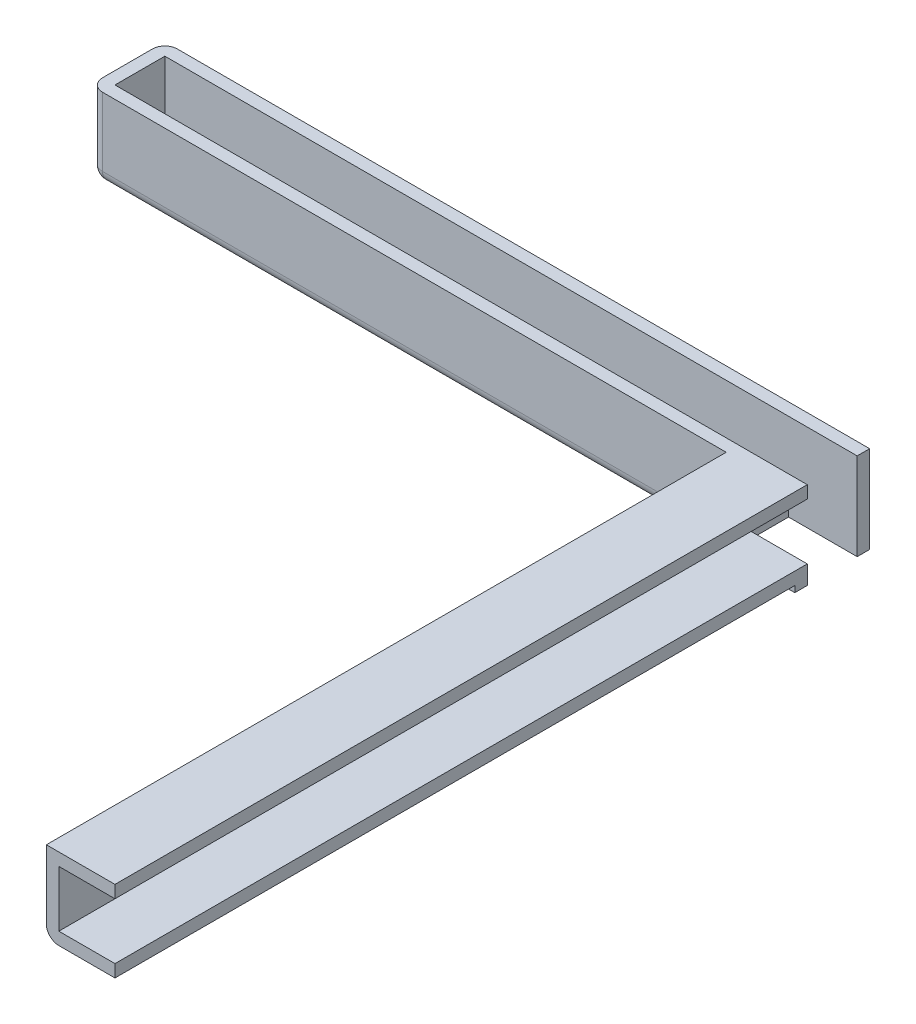
ISO-10303-21;
HEADER;
FILE_DESCRIPTION(('STEP AP214'),'2;1');
FILE_NAME('part.step','',(''),(''),'','','');
FILE_SCHEMA(('AUTOMOTIVE_DESIGN { 1 0 10303 214 1 1 1 1 }'));
ENDSEC;
DATA;
#1=APPLICATION_CONTEXT('core data for automotive mechanical design processes');
#2=APPLICATION_PROTOCOL_DEFINITION('international standard','automotive_design',2000,#1);
#3=PRODUCT_CONTEXT('',#1,'mechanical');
#4=PRODUCT('Part','Part','',(#3));
#5=PRODUCT_RELATED_PRODUCT_CATEGORY('part','',(#4));
#6=PRODUCT_DEFINITION_FORMATION('','',#4);
#7=PRODUCT_DEFINITION_CONTEXT('part definition',#1,'design');
#8=PRODUCT_DEFINITION('design','',#6,#7);
#9=PRODUCT_DEFINITION_SHAPE('','',#8);
#10=(LENGTH_UNIT() NAMED_UNIT(*) SI_UNIT(.MILLI.,.METRE.));
#11=(NAMED_UNIT(*) PLANE_ANGLE_UNIT() SI_UNIT($,.RADIAN.));
#12=(NAMED_UNIT(*) SI_UNIT($,.STERADIAN.) SOLID_ANGLE_UNIT());
#13=UNCERTAINTY_MEASURE_WITH_UNIT(LENGTH_MEASURE(1.E-05),#10,'distance_accuracy_value','');
#14=(GEOMETRIC_REPRESENTATION_CONTEXT(3) GLOBAL_UNCERTAINTY_ASSIGNED_CONTEXT((#13)) GLOBAL_UNIT_ASSIGNED_CONTEXT((#10,
#11,#12)) REPRESENTATION_CONTEXT('',''));
#15=CARTESIAN_POINT('',(0.,0.,0.));
#16=DIRECTION('',(0.,0.,1.));
#17=DIRECTION('',(1.,0.,0.));
#18=AXIS2_PLACEMENT_3D('',#15,#16,#17);
#19=CARTESIAN_POINT('',(0.,2.,12.));
#20=DIRECTION('',(0.,0.,-1.));
#21=DIRECTION('',(-1.,0.,0.));
#22=AXIS2_PLACEMENT_3D('',#19,#20,#21);
#23=PLANE('',#22);
#24=CARTESIAN_POINT('',(104.,2.,12.));
#25=DIRECTION('',(0.,0.,-1.));
#26=DIRECTION('',(-1.,0.,0.));
#27=AXIS2_PLACEMENT_3D('',#24,#25,#26);
#28=CIRCLE('',#27,2.);
#29=CARTESIAN_POINT('',(104.,0.,12.));
#30=VERTEX_POINT('',#29);
#31=CARTESIAN_POINT('',(102.,2.,12.));
#32=VERTEX_POINT('',#31);
#33=EDGE_CURVE('E51',#30,#32,#28,.T.);
#34=ORIENTED_EDGE('',*,*,#33,.T.);
#35=DIRECTION('',(0.,1.,0.));
#36=VECTOR('',#35,1.);
#37=CARTESIAN_POINT('',(102.,-1.,12.));
#38=LINE('',#37,#36);
#39=CARTESIAN_POINT('',(102.,-1.,12.));
#40=VERTEX_POINT('',#39);
#41=EDGE_CURVE('E11',#32,#40,#38,.F.);
#42=ORIENTED_EDGE('',*,*,#41,.T.);
#43=DIRECTION('',(1.,0.,0.));
#44=VECTOR('',#43,1.);
#45=CARTESIAN_POINT('',(0.,-1.,12.));
#46=LINE('',#45,#44);
#47=CARTESIAN_POINT('',(113.,-1.,12.));
#48=VERTEX_POINT('',#47);
#49=EDGE_CURVE('E209',#40,#48,#46,.T.);
#50=ORIENTED_EDGE('',*,*,#49,.T.);
#51=DIRECTION('',(0.,1.,0.));
#52=VECTOR('',#51,1.);
#53=CARTESIAN_POINT('',(113.,-1.,12.));
#54=LINE('',#53,#52);
#55=CARTESIAN_POINT('',(113.,0.,12.));
#56=VERTEX_POINT('',#55);
#57=EDGE_CURVE('E213',#48,#56,#54,.T.);
#58=ORIENTED_EDGE('',*,*,#57,.T.);
#59=DIRECTION('',(1.,0.,0.));
#60=VECTOR('',#59,1.);
#61=CARTESIAN_POINT('',(0.,0.,12.));
#62=LINE('',#61,#60);
#63=EDGE_CURVE('E250',#30,#56,#62,.T.);
#64=ORIENTED_EDGE('',*,*,#63,.F.);
#65=EDGE_LOOP('',(#34,#42,#50,#58,#64));
#66=FACE_BOUND('',#65,.T.);
#67=ADVANCED_FACE('F41',(#66),#23,.F.);
#68=CARTESIAN_POINT('',(0.,0.,0.));
#69=DIRECTION('',(0.,1.,0.));
#70=DIRECTION('',(0.,0.,1.));
#71=AXIS2_PLACEMENT_3D('',#68,#69,#70);
#72=PLANE('',#71);
#73=DIRECTION('',(0.,0.,1.));
#74=VECTOR('',#73,1.);
#75=CARTESIAN_POINT('',(2.,0.,0.));
#76=LINE('',#75,#74);
#77=CARTESIAN_POINT('',(2.,0.,10.));
#78=VERTEX_POINT('',#77);
#79=CARTESIAN_POINT('',(2.,0.,2.));
#80=VERTEX_POINT('',#79);
#81=EDGE_CURVE('E67',#78,#80,#76,.F.);
#82=ORIENTED_EDGE('',*,*,#81,.T.);
#83=DIRECTION('',(1.,0.,0.));
#84=VECTOR('',#83,1.);
#85=CARTESIAN_POINT('',(100.,0.,2.));
#86=LINE('',#85,#84);
#87=CARTESIAN_POINT('',(100.,0.,2.));
#88=VERTEX_POINT('',#87);
#89=EDGE_CURVE('E428',#80,#88,#86,.T.);
#90=ORIENTED_EDGE('',*,*,#89,.T.);
#91=DIRECTION('',(0.,0.,1.));
#92=VECTOR('',#91,1.);
#93=CARTESIAN_POINT('',(100.,0.,0.));
#94=LINE('',#93,#92);
#95=CARTESIAN_POINT('',(100.,0.,10.));
#96=VERTEX_POINT('',#95);
#97=EDGE_CURVE('E468',#88,#96,#94,.T.);
#98=ORIENTED_EDGE('',*,*,#97,.T.);
#99=DIRECTION('',(1.,0.,0.));
#100=VECTOR('',#99,1.);
#101=CARTESIAN_POINT('',(0.,0.,10.));
#102=LINE('',#101,#100);
#103=EDGE_CURVE('E423',#96,#78,#102,.F.);
#104=ORIENTED_EDGE('',*,*,#103,.T.);
#105=EDGE_LOOP('',(#82,#90,#98,#104));
#106=FACE_BOUND('',#105,.T.);
#107=ADVANCED_FACE('F497',(#106),#72,.F.);
#108=DIRECTION('',(1.,0.,0.));
#109=VECTOR('',#108,1.);
#110=CARTESIAN_POINT('',(0.,13.,12.));
#111=LINE('',#110,#109);
#112=CARTESIAN_POINT('',(2.,13.,12.));
#113=VERTEX_POINT('',#112);
#114=CARTESIAN_POINT('',(102.,13.,12.));
#115=VERTEX_POINT('',#114);
#116=EDGE_CURVE('E327',#113,#115,#111,.T.);
#117=ORIENTED_EDGE('',*,*,#116,.F.);
#118=DIRECTION('',(0.,-1.,0.));
#119=VECTOR('',#118,1.);
#120=CARTESIAN_POINT('',(2.,2.,12.));
#121=LINE('',#120,#119);
#122=CARTESIAN_POINT('',(2.,2.,12.));
#123=VERTEX_POINT('',#122);
#124=EDGE_CURVE('E59',#113,#123,#121,.T.);
#125=ORIENTED_EDGE('',*,*,#124,.T.);
#126=DIRECTION('',(1.,0.,0.));
#127=VECTOR('',#126,1.);
#128=CARTESIAN_POINT('',(0.,2.,12.));
#129=LINE('',#128,#127);
#130=EDGE_CURVE('E431',#123,#32,#129,.T.);
#131=ORIENTED_EDGE('',*,*,#130,.T.);
#132=DIRECTION('',(0.,1.,0.));
#133=VECTOR('',#132,1.);
#134=CARTESIAN_POINT('',(102.,0.,12.));
#135=LINE('',#134,#133);
#136=EDGE_CURVE('E239',#32,#115,#135,.T.);
#137=ORIENTED_EDGE('',*,*,#136,.T.);
#138=EDGE_LOOP('',(#117,#125,#131,#137));
#139=FACE_BOUND('',#138,.T.);
#140=ADVANCED_FACE('F499',(#139),#23,.F.);
#141=CARTESIAN_POINT('',(113.,2.,0.));
#142=DIRECTION('',(1.,0.,0.));
#143=DIRECTION('',(0.,0.,-1.));
#144=AXIS2_PLACEMENT_3D('',#141,#142,#143);
#145=PLANE('',#144);
#146=DIRECTION('',(0.,-1.,0.));
#147=VECTOR('',#146,1.);
#148=CARTESIAN_POINT('',(113.,2.,10.));
#149=LINE('',#148,#147);
#150=CARTESIAN_POINT('',(113.,2.,10.));
#151=VERTEX_POINT('',#150);
#152=CARTESIAN_POINT('',(113.,-1.,10.));
#153=VERTEX_POINT('',#152);
#154=EDGE_CURVE('E372',#151,#153,#149,.T.);
#155=ORIENTED_EDGE('',*,*,#154,.F.);
#156=DIRECTION('',(0.,0.,1.));
#157=VECTOR('',#156,1.);
#158=CARTESIAN_POINT('',(113.,2.,-2.72792206135785));
#159=LINE('',#158,#157);
#160=CARTESIAN_POINT('',(113.,2.,121.));
#161=VERTEX_POINT('',#160);
#162=EDGE_CURVE('E298',#151,#161,#159,.T.);
#163=ORIENTED_EDGE('',*,*,#162,.T.);
#164=DIRECTION('',(0.,1.,0.));
#165=VECTOR('',#164,1.);
#166=CARTESIAN_POINT('',(113.,0.,121.));
#167=LINE('',#166,#165);
#168=CARTESIAN_POINT('',(113.,0.,121.));
#169=VERTEX_POINT('',#168);
#170=EDGE_CURVE('E257',#169,#161,#167,.T.);
#171=ORIENTED_EDGE('',*,*,#170,.F.);
#172=DIRECTION('',(0.,0.,1.));
#173=VECTOR('',#172,1.);
#174=CARTESIAN_POINT('',(113.,0.,0.));
#175=LINE('',#174,#173);
#176=EDGE_CURVE('E237',#56,#169,#175,.T.);
#177=ORIENTED_EDGE('',*,*,#176,.F.);
#178=ORIENTED_EDGE('',*,*,#57,.F.);
#179=DIRECTION('',(0.,0.,1.));
#180=VECTOR('',#179,1.);
#181=CARTESIAN_POINT('',(113.,-1.,0.));
#182=LINE('',#181,#180);
#183=EDGE_CURVE('E219',#153,#48,#182,.T.);
#184=ORIENTED_EDGE('',*,*,#183,.F.);
#185=EDGE_LOOP('',(#155,#163,#171,#177,#178,#184));
#186=FACE_BOUND('',#185,.T.);
#187=ADVANCED_FACE('F234',(#186),#145,.T.);
#188=CARTESIAN_POINT('',(0.,2.,10.));
#189=DIRECTION('',(0.,0.,1.));
#190=DIRECTION('',(1.,0.,0.));
#191=AXIS2_PLACEMENT_3D('',#188,#189,#190);
#192=PLANE('',#191);
#193=DIRECTION('',(1.,0.,0.));
#194=VECTOR('',#193,1.);
#195=CARTESIAN_POINT('',(0.,2.,10.));
#196=LINE('',#195,#194);
#197=CARTESIAN_POINT('',(104.,2.,10.));
#198=VERTEX_POINT('',#197);
#199=EDGE_CURVE('E287',#198,#151,#196,.T.);
#200=ORIENTED_EDGE('',*,*,#199,.T.);
#201=ORIENTED_EDGE('',*,*,#154,.T.);
#202=DIRECTION('',(-1.,0.,0.));
#203=VECTOR('',#202,1.);
#204=CARTESIAN_POINT('',(0.,-1.,10.));
#205=LINE('',#204,#203);
#206=CARTESIAN_POINT('',(102.,-1.,10.));
#207=VERTEX_POINT('',#206);
#208=EDGE_CURVE('E228',#153,#207,#205,.T.);
#209=ORIENTED_EDGE('',*,*,#208,.T.);
#210=DIRECTION('',(0.,-1.,0.));
#211=VECTOR('',#210,1.);
#212=CARTESIAN_POINT('',(102.,2.,10.));
#213=LINE('',#212,#211);
#214=CARTESIAN_POINT('',(102.,2.,10.));
#215=VERTEX_POINT('',#214);
#216=EDGE_CURVE('E369',#215,#207,#213,.T.);
#217=ORIENTED_EDGE('',*,*,#216,.F.);
#218=DIRECTION('',(-1.,0.,0.));
#219=VECTOR('',#218,1.);
#220=CARTESIAN_POINT('',(0.,2.,10.));
#221=LINE('',#220,#219);
#222=CARTESIAN_POINT('',(2.,2.,10.));
#223=VERTEX_POINT('',#222);
#224=EDGE_CURVE('E343',#215,#223,#221,.T.);
#225=ORIENTED_EDGE('',*,*,#224,.T.);
#226=DIRECTION('',(0.,-1.,0.));
#227=VECTOR('',#226,1.);
#228=CARTESIAN_POINT('',(2.,13.,10.));
#229=LINE('',#228,#227);
#230=CARTESIAN_POINT('',(2.,13.,10.));
#231=VERTEX_POINT('',#230);
#232=EDGE_CURVE('E337',#231,#223,#229,.T.);
#233=ORIENTED_EDGE('',*,*,#232,.F.);
#234=DIRECTION('',(-1.,0.,0.));
#235=VECTOR('',#234,1.);
#236=CARTESIAN_POINT('',(0.,13.,10.));
#237=LINE('',#236,#235);
#238=CARTESIAN_POINT('',(113.,13.,10.));
#239=VERTEX_POINT('',#238);
#240=EDGE_CURVE('E334',#239,#231,#237,.T.);
#241=ORIENTED_EDGE('',*,*,#240,.F.);
#242=CARTESIAN_POINT('',(113.,11.,10.));
#243=VERTEX_POINT('',#242);
#244=EDGE_CURVE('E346',#239,#243,#149,.T.);
#245=ORIENTED_EDGE('',*,*,#244,.T.);
#246=DIRECTION('',(1.,0.,0.));
#247=VECTOR('',#246,1.);
#248=CARTESIAN_POINT('',(0.,11.,10.));
#249=LINE('',#248,#247);
#250=CARTESIAN_POINT('',(104.,11.,10.));
#251=VERTEX_POINT('',#250);
#252=EDGE_CURVE('E283',#251,#243,#249,.T.);
#253=ORIENTED_EDGE('',*,*,#252,.F.);
#254=DIRECTION('',(0.,-1.,0.));
#255=VECTOR('',#254,1.);
#256=CARTESIAN_POINT('',(104.,1.60365548001412E-13,10.));
#257=LINE('',#256,#255);
#258=EDGE_CURVE('E286',#251,#198,#257,.T.);
#259=ORIENTED_EDGE('',*,*,#258,.T.);
#260=EDGE_LOOP('',(#200,#201,#209,#217,#225,#233,#241,#245,#253,#259));
#261=FACE_BOUND('',#260,.T.);
#262=ADVANCED_FACE('F576',(#261),#192,.F.);
#263=CARTESIAN_POINT('',(0.,2.,0.));
#264=DIRECTION('',(0.,0.,-1.));
#265=DIRECTION('',(-1.,0.,0.));
#266=AXIS2_PLACEMENT_3D('',#263,#264,#265);
#267=PLANE('',#266);
#268=DIRECTION('',(1.,0.,0.));
#269=VECTOR('',#268,1.);
#270=CARTESIAN_POINT('',(0.,-1.,0.));
#271=LINE('',#270,#269);
#272=CARTESIAN_POINT('',(102.,-1.,0.));
#273=VERTEX_POINT('',#272);
#274=CARTESIAN_POINT('',(113.,-1.,0.));
#275=VERTEX_POINT('',#274);
#276=EDGE_CURVE('E474',#273,#275,#271,.T.);
#277=ORIENTED_EDGE('',*,*,#276,.F.);
#278=DIRECTION('',(0.,1.,0.));
#279=VECTOR('',#278,1.);
#280=CARTESIAN_POINT('',(102.,2.,0.));
#281=LINE('',#280,#279);
#282=CARTESIAN_POINT('',(102.,2.,0.));
#283=VERTEX_POINT('',#282);
#284=EDGE_CURVE('E392',#273,#283,#281,.T.);
#285=ORIENTED_EDGE('',*,*,#284,.T.);
#286=DIRECTION('',(1.,0.,0.));
#287=VECTOR('',#286,1.);
#288=CARTESIAN_POINT('',(0.,2.,0.));
#289=LINE('',#288,#287);
#290=CARTESIAN_POINT('',(2.,2.,0.));
#291=VERTEX_POINT('',#290);
#292=EDGE_CURVE('E386',#283,#291,#289,.F.);
#293=ORIENTED_EDGE('',*,*,#292,.T.);
#294=DIRECTION('',(0.,-1.,0.));
#295=VECTOR('',#294,1.);
#296=CARTESIAN_POINT('',(2.,13.,0.));
#297=LINE('',#296,#295);
#298=CARTESIAN_POINT('',(2.,13.,0.));
#299=VERTEX_POINT('',#298);
#300=EDGE_CURVE('E389',#291,#299,#297,.F.);
#301=ORIENTED_EDGE('',*,*,#300,.T.);
#302=DIRECTION('',(-1.,0.,0.));
#303=VECTOR('',#302,1.);
#304=CARTESIAN_POINT('',(0.,13.,0.));
#305=LINE('',#304,#303);
#306=CARTESIAN_POINT('',(113.,13.,0.));
#307=VERTEX_POINT('',#306);
#308=EDGE_CURVE('E319',#307,#299,#305,.T.);
#309=ORIENTED_EDGE('',*,*,#308,.F.);
#310=DIRECTION('',(0.,-1.,0.));
#311=VECTOR('',#310,1.);
#312=CARTESIAN_POINT('',(113.,2.,0.));
#313=LINE('',#312,#311);
#314=EDGE_CURVE('E357',#307,#275,#313,.T.);
#315=ORIENTED_EDGE('',*,*,#314,.T.);
#316=EDGE_LOOP('',(#277,#285,#293,#301,#309,#315));
#317=FACE_BOUND('',#316,.T.);
#318=ADVANCED_FACE('F558',(#317),#267,.T.);
#319=CARTESIAN_POINT('',(0.,2.,0.));
#320=DIRECTION('',(1.,0.,0.));
#321=DIRECTION('',(0.,0.,-1.));
#322=AXIS2_PLACEMENT_3D('',#319,#320,#321);
#323=PLANE('',#322);
#324=DIRECTION('',(0.,0.,1.));
#325=VECTOR('',#324,1.);
#326=CARTESIAN_POINT('',(0.,13.,0.));
#327=LINE('',#326,#325);
#328=CARTESIAN_POINT('',(0.,13.,2.));
#329=VERTEX_POINT('',#328);
#330=CARTESIAN_POINT('',(0.,13.,10.));
#331=VERTEX_POINT('',#330);
#332=EDGE_CURVE('E323',#329,#331,#327,.T.);
#333=ORIENTED_EDGE('',*,*,#332,.F.);
#334=DIRECTION('',(0.,-1.,0.));
#335=VECTOR('',#334,1.);
#336=CARTESIAN_POINT('',(0.,0.,2.));
#337=LINE('',#336,#335);
#338=CARTESIAN_POINT('',(0.,2.,2.));
#339=VERTEX_POINT('',#338);
#340=EDGE_CURVE('E414',#329,#339,#337,.T.);
#341=ORIENTED_EDGE('',*,*,#340,.T.);
#342=DIRECTION('',(0.,0.,1.));
#343=VECTOR('',#342,1.);
#344=CARTESIAN_POINT('',(0.,2.,0.));
#345=LINE('',#344,#343);
#346=CARTESIAN_POINT('',(0.,2.,10.));
#347=VERTEX_POINT('',#346);
#348=EDGE_CURVE('E411',#339,#347,#345,.T.);
#349=ORIENTED_EDGE('',*,*,#348,.T.);
#350=DIRECTION('',(0.,-1.,0.));
#351=VECTOR('',#350,1.);
#352=CARTESIAN_POINT('',(0.,2.,10.));
#353=LINE('',#352,#351);
#354=EDGE_CURVE('E408',#347,#331,#353,.F.);
#355=ORIENTED_EDGE('',*,*,#354,.T.);
#356=EDGE_LOOP('',(#333,#341,#349,#355));
#357=FACE_BOUND('',#356,.T.);
#358=ADVANCED_FACE('F598',(#357),#323,.F.);
#359=DIRECTION('',(0.,0.,1.));
#360=VECTOR('',#359,1.);
#361=CARTESIAN_POINT('',(113.,11.,-2.72792206135785));
#362=LINE('',#361,#360);
#363=CARTESIAN_POINT('',(113.,11.,121.));
#364=VERTEX_POINT('',#363);
#365=EDGE_CURVE('E295',#243,#364,#362,.T.);
#366=ORIENTED_EDGE('',*,*,#365,.F.);
#367=ORIENTED_EDGE('',*,*,#244,.F.);
#368=DIRECTION('',(0.,0.,-1.));
#369=VECTOR('',#368,1.);
#370=CARTESIAN_POINT('',(113.,13.,0.));
#371=LINE('',#370,#369);
#372=CARTESIAN_POINT('',(113.,13.,121.));
#373=VERTEX_POINT('',#372);
#374=EDGE_CURVE('E330',#373,#239,#371,.T.);
#375=ORIENTED_EDGE('',*,*,#374,.F.);
#376=EDGE_CURVE('E262',#364,#373,#167,.T.);
#377=ORIENTED_EDGE('',*,*,#376,.F.);
#378=EDGE_LOOP('',(#366,#367,#375,#377));
#379=FACE_BOUND('',#378,.T.);
#380=ADVANCED_FACE('F586',(#379),#145,.T.);
#381=CARTESIAN_POINT('',(102.,2.,0.));
#382=DIRECTION('',(1.,0.,0.));
#383=DIRECTION('',(0.,0.,-1.));
#384=AXIS2_PLACEMENT_3D('',#381,#382,#383);
#385=PLANE('',#384);
#386=ORIENTED_EDGE('',*,*,#216,.T.);
#387=DIRECTION('',(0.,0.,1.));
#388=VECTOR('',#387,1.);
#389=CARTESIAN_POINT('',(102.,-1.,0.));
#390=LINE('',#389,#388);
#391=CARTESIAN_POINT('',(102.,-1.,2.));
#392=VERTEX_POINT('',#391);
#393=EDGE_CURVE('E482',#392,#207,#390,.T.);
#394=ORIENTED_EDGE('',*,*,#393,.F.);
#395=DIRECTION('',(0.,-1.,0.));
#396=VECTOR('',#395,1.);
#397=CARTESIAN_POINT('',(102.,2.,2.));
#398=LINE('',#397,#396);
#399=CARTESIAN_POINT('',(102.,2.,2.));
#400=VERTEX_POINT('',#399);
#401=EDGE_CURVE('E366',#400,#392,#398,.T.);
#402=ORIENTED_EDGE('',*,*,#401,.F.);
#403=DIRECTION('',(0.,0.,1.));
#404=VECTOR('',#403,1.);
#405=CARTESIAN_POINT('',(102.,2.,0.));
#406=LINE('',#405,#404);
#407=EDGE_CURVE('E353',#400,#215,#406,.T.);
#408=ORIENTED_EDGE('',*,*,#407,.T.);
#409=EDGE_LOOP('',(#386,#394,#402,#408));
#410=FACE_BOUND('',#409,.T.);
#411=ADVANCED_FACE('F571',(#410),#385,.T.);
#412=CARTESIAN_POINT('',(0.,2.,2.00000000000001));
#413=DIRECTION('',(0.,0.,1.));
#414=DIRECTION('',(1.,0.,0.));
#415=AXIS2_PLACEMENT_3D('',#412,#413,#414);
#416=PLANE('',#415);
#417=ORIENTED_EDGE('',*,*,#401,.T.);
#418=DIRECTION('',(-1.,0.,0.));
#419=VECTOR('',#418,1.);
#420=CARTESIAN_POINT('',(0.,-1.,2.00000000000001));
#421=LINE('',#420,#419);
#422=CARTESIAN_POINT('',(113.,-1.,2.));
#423=VERTEX_POINT('',#422);
#424=EDGE_CURVE('E247',#423,#392,#421,.T.);
#425=ORIENTED_EDGE('',*,*,#424,.F.);
#426=DIRECTION('',(0.,-1.,0.));
#427=VECTOR('',#426,1.);
#428=CARTESIAN_POINT('',(113.,2.,2.));
#429=LINE('',#428,#427);
#430=CARTESIAN_POINT('',(113.,13.,2.));
#431=VERTEX_POINT('',#430);
#432=EDGE_CURVE('E363',#431,#423,#429,.T.);
#433=ORIENTED_EDGE('',*,*,#432,.F.);
#434=DIRECTION('',(1.,0.,0.));
#435=VECTOR('',#434,1.);
#436=CARTESIAN_POINT('',(0.,13.,2.00000000000001));
#437=LINE('',#436,#435);
#438=CARTESIAN_POINT('',(2.,13.,2.00000000000001));
#439=VERTEX_POINT('',#438);
#440=EDGE_CURVE('E310',#439,#431,#437,.T.);
#441=ORIENTED_EDGE('',*,*,#440,.F.);
#442=DIRECTION('',(0.,-1.,0.));
#443=VECTOR('',#442,1.);
#444=CARTESIAN_POINT('',(2.,13.,2.00000000000001));
#445=LINE('',#444,#443);
#446=CARTESIAN_POINT('',(2.,2.,2.00000000000001));
#447=VERTEX_POINT('',#446);
#448=EDGE_CURVE('E350',#439,#447,#445,.T.);
#449=ORIENTED_EDGE('',*,*,#448,.T.);
#450=DIRECTION('',(1.,0.,0.));
#451=VECTOR('',#450,1.);
#452=CARTESIAN_POINT('',(0.,2.,2.00000000000001));
#453=LINE('',#452,#451);
#454=EDGE_CURVE('E311',#447,#400,#453,.T.);
#455=ORIENTED_EDGE('',*,*,#454,.T.);
#456=EDGE_LOOP('',(#417,#425,#433,#441,#449,#455));
#457=FACE_BOUND('',#456,.T.);
#458=ADVANCED_FACE('F566',(#457),#416,.T.);
#459=ORIENTED_EDGE('',*,*,#432,.T.);
#460=EDGE_CURVE('E233',#275,#423,#182,.T.);
#461=ORIENTED_EDGE('',*,*,#460,.F.);
#462=ORIENTED_EDGE('',*,*,#314,.F.);
#463=DIRECTION('',(0.,0.,-1.));
#464=VECTOR('',#463,1.);
#465=CARTESIAN_POINT('',(113.,13.,0.));
#466=LINE('',#465,#464);
#467=EDGE_CURVE('E315',#431,#307,#466,.T.);
#468=ORIENTED_EDGE('',*,*,#467,.F.);
#469=EDGE_LOOP('',(#459,#461,#462,#468));
#470=FACE_BOUND('',#469,.T.);
#471=ADVANCED_FACE('F520',(#470),#145,.T.);
#472=CARTESIAN_POINT('',(0.,2.,0.));
#473=DIRECTION('',(0.,1.,0.));
#474=DIRECTION('',(0.,0.,1.));
#475=AXIS2_PLACEMENT_3D('',#472,#473,#474);
#476=PLANE('',#475);
#477=ORIENTED_EDGE('',*,*,#224,.F.);
#478=ORIENTED_EDGE('',*,*,#407,.F.);
#479=ORIENTED_EDGE('',*,*,#454,.F.);
#480=DIRECTION('',(0.,0.,-1.));
#481=VECTOR('',#480,1.);
#482=CARTESIAN_POINT('',(2.,2.,0.));
#483=LINE('',#482,#481);
#484=EDGE_CURVE('E291',#223,#447,#483,.T.);
#485=ORIENTED_EDGE('',*,*,#484,.F.);
#486=EDGE_LOOP('',(#477,#478,#479,#485));
#487=FACE_BOUND('',#486,.T.);
#488=ADVANCED_FACE('F511',(#487),#476,.T.);
#489=DIRECTION('',(1.,0.,0.));
#490=VECTOR('',#489,1.);
#491=CARTESIAN_POINT('',(0.,0.,121.));
#492=LINE('',#491,#490);
#493=CARTESIAN_POINT('',(104.,0.,121.));
#494=VERTEX_POINT('',#493);
#495=EDGE_CURVE('E254',#494,#169,#492,.T.);
#496=ORIENTED_EDGE('',*,*,#495,.F.);
#497=DIRECTION('',(0.,0.,-1.));
#498=VECTOR('',#497,1.);
#499=CARTESIAN_POINT('',(104.,0.,12.));
#500=LINE('',#499,#498);
#501=EDGE_CURVE('E376',#494,#30,#500,.T.);
#502=ORIENTED_EDGE('',*,*,#501,.T.);
#503=ORIENTED_EDGE('',*,*,#63,.T.);
#504=ORIENTED_EDGE('',*,*,#176,.T.);
#505=EDGE_LOOP('',(#496,#502,#503,#504));
#506=FACE_BOUND('',#505,.T.);
#507=ADVANCED_FACE('F501',(#506),#72,.F.);
#508=CARTESIAN_POINT('',(2.,13.,0.));
#509=DIRECTION('',(-1.,0.,0.));
#510=DIRECTION('',(0.,0.,1.));
#511=AXIS2_PLACEMENT_3D('',#508,#509,#510);
#512=PLANE('',#511);
#513=ORIENTED_EDGE('',*,*,#484,.T.);
#514=ORIENTED_EDGE('',*,*,#448,.F.);
#515=DIRECTION('',(0.,0.,-1.));
#516=VECTOR('',#515,1.);
#517=CARTESIAN_POINT('',(2.,13.,0.));
#518=LINE('',#517,#516);
#519=EDGE_CURVE('E306',#231,#439,#518,.T.);
#520=ORIENTED_EDGE('',*,*,#519,.F.);
#521=ORIENTED_EDGE('',*,*,#232,.T.);
#522=EDGE_LOOP('',(#513,#514,#520,#521));
#523=FACE_BOUND('',#522,.T.);
#524=ADVANCED_FACE('F510',(#523),#512,.F.);
#525=CARTESIAN_POINT('',(0.,13.,0.));
#526=DIRECTION('',(0.,1.,0.));
#527=DIRECTION('',(0.,0.,1.));
#528=AXIS2_PLACEMENT_3D('',#525,#526,#527);
#529=PLANE('',#528);
#530=ORIENTED_EDGE('',*,*,#308,.T.);
#531=CARTESIAN_POINT('',(2.,13.,2.));
#532=DIRECTION('',(0.,1.,0.));
#533=DIRECTION('',(0.,0.,1.));
#534=AXIS2_PLACEMENT_3D('',#531,#532,#533);
#535=CIRCLE('',#534,2.);
#536=EDGE_CURVE('E420',#299,#329,#535,.T.);
#537=ORIENTED_EDGE('',*,*,#536,.T.);
#538=ORIENTED_EDGE('',*,*,#332,.T.);
#539=CARTESIAN_POINT('',(2.,13.,10.));
#540=DIRECTION('',(0.,1.,0.));
#541=DIRECTION('',(0.,0.,1.));
#542=AXIS2_PLACEMENT_3D('',#539,#540,#541);
#543=CIRCLE('',#542,2.);
#544=EDGE_CURVE('E417',#331,#113,#543,.T.);
#545=ORIENTED_EDGE('',*,*,#544,.T.);
#546=ORIENTED_EDGE('',*,*,#116,.T.);
#547=DIRECTION('',(0.,0.,-1.));
#548=VECTOR('',#547,1.);
#549=CARTESIAN_POINT('',(102.,13.,121.));
#550=LINE('',#549,#548);
#551=CARTESIAN_POINT('',(102.,13.,121.));
#552=VERTEX_POINT('',#551);
#553=EDGE_CURVE('E277',#552,#115,#550,.T.);
#554=ORIENTED_EDGE('',*,*,#553,.F.);
#555=DIRECTION('',(-1.,0.,0.));
#556=VECTOR('',#555,1.);
#557=CARTESIAN_POINT('',(0.,13.,121.));
#558=LINE('',#557,#556);
#559=EDGE_CURVE('E274',#373,#552,#558,.T.);
#560=ORIENTED_EDGE('',*,*,#559,.F.);
#561=ORIENTED_EDGE('',*,*,#374,.T.);
#562=ORIENTED_EDGE('',*,*,#240,.T.);
#563=ORIENTED_EDGE('',*,*,#519,.T.);
#564=ORIENTED_EDGE('',*,*,#440,.T.);
#565=ORIENTED_EDGE('',*,*,#467,.T.);
#566=EDGE_LOOP('',(#530,#537,#538,#545,#546,#554,#560,#561,#562,#563,#564,#565));
#567=FACE_BOUND('',#566,.T.);
#568=ADVANCED_FACE('F517',(#567),#529,.T.);
#569=CARTESIAN_POINT('',(0.,2.,-2.72792206135785));
#570=DIRECTION('',(0.,1.,0.));
#571=DIRECTION('',(0.,0.,1.));
#572=AXIS2_PLACEMENT_3D('',#569,#570,#571);
#573=PLANE('',#572);
#574=DIRECTION('',(0.,0.,1.));
#575=VECTOR('',#574,1.);
#576=CARTESIAN_POINT('',(104.,2.,-2.72792206135785));
#577=LINE('',#576,#575);
#578=CARTESIAN_POINT('',(104.,2.,121.));
#579=VERTEX_POINT('',#578);
#580=EDGE_CURVE('E282',#198,#579,#577,.T.);
#581=ORIENTED_EDGE('',*,*,#580,.T.);
#582=DIRECTION('',(-1.,0.,0.));
#583=VECTOR('',#582,1.);
#584=CARTESIAN_POINT('',(0.,2.,121.));
#585=LINE('',#584,#583);
#586=EDGE_CURVE('E261',#161,#579,#585,.T.);
#587=ORIENTED_EDGE('',*,*,#586,.F.);
#588=ORIENTED_EDGE('',*,*,#162,.F.);
#589=ORIENTED_EDGE('',*,*,#199,.F.);
#590=EDGE_LOOP('',(#581,#587,#588,#589));
#591=FACE_BOUND('',#590,.T.);
#592=ADVANCED_FACE('F674',(#591),#573,.T.);
#593=CARTESIAN_POINT('',(0.,11.,-2.72792206135785));
#594=DIRECTION('',(0.,1.,0.));
#595=DIRECTION('',(-1.,0.,0.));
#596=AXIS2_PLACEMENT_3D('',#593,#594,#595);
#597=PLANE('',#596);
#598=ORIENTED_EDGE('',*,*,#252,.T.);
#599=ORIENTED_EDGE('',*,*,#365,.T.);
#600=DIRECTION('',(-1.,0.,0.));
#601=VECTOR('',#600,1.);
#602=CARTESIAN_POINT('',(0.,11.,121.));
#603=LINE('',#602,#601);
#604=CARTESIAN_POINT('',(104.,11.,121.));
#605=VERTEX_POINT('',#604);
#606=EDGE_CURVE('E270',#364,#605,#603,.T.);
#607=ORIENTED_EDGE('',*,*,#606,.T.);
#608=DIRECTION('',(0.,0.,1.));
#609=VECTOR('',#608,1.);
#610=CARTESIAN_POINT('',(104.,11.,-2.72792206135785));
#611=LINE('',#610,#609);
#612=EDGE_CURVE('E292',#251,#605,#611,.T.);
#613=ORIENTED_EDGE('',*,*,#612,.F.);
#614=EDGE_LOOP('',(#598,#599,#607,#613));
#615=FACE_BOUND('',#614,.T.);
#616=ADVANCED_FACE('F665',(#615),#597,.F.);
#617=CARTESIAN_POINT('',(104.,1.60365548001412E-13,-2.72792206135785));
#618=DIRECTION('',(1.,0.,0.));
#619=DIRECTION('',(0.,1.,0.));
#620=AXIS2_PLACEMENT_3D('',#617,#618,#619);
#621=PLANE('',#620);
#622=ORIENTED_EDGE('',*,*,#612,.T.);
#623=DIRECTION('',(0.,1.,0.));
#624=VECTOR('',#623,1.);
#625=CARTESIAN_POINT('',(104.,1.60365548001412E-13,121.));
#626=LINE('',#625,#624);
#627=EDGE_CURVE('E266',#579,#605,#626,.T.);
#628=ORIENTED_EDGE('',*,*,#627,.F.);
#629=ORIENTED_EDGE('',*,*,#580,.F.);
#630=ORIENTED_EDGE('',*,*,#258,.F.);
#631=EDGE_LOOP('',(#622,#628,#629,#630));
#632=FACE_BOUND('',#631,.T.);
#633=ADVANCED_FACE('F657',(#632),#621,.T.);
#634=CARTESIAN_POINT('',(102.,0.,121.));
#635=DIRECTION('',(-1.,0.,0.));
#636=DIRECTION('',(0.,0.,1.));
#637=AXIS2_PLACEMENT_3D('',#634,#635,#636);
#638=PLANE('',#637);
#639=ORIENTED_EDGE('',*,*,#136,.F.);
#640=DIRECTION('',(0.,0.,-1.));
#641=VECTOR('',#640,1.);
#642=CARTESIAN_POINT('',(102.,2.,121.));
#643=LINE('',#642,#641);
#644=CARTESIAN_POINT('',(102.,2.,121.));
#645=VERTEX_POINT('',#644);
#646=EDGE_CURVE('E380',#32,#645,#643,.F.);
#647=ORIENTED_EDGE('',*,*,#646,.T.);
#648=DIRECTION('',(0.,1.,0.));
#649=VECTOR('',#648,1.);
#650=CARTESIAN_POINT('',(102.,0.,121.));
#651=LINE('',#650,#649);
#652=EDGE_CURVE('E244',#645,#552,#651,.T.);
#653=ORIENTED_EDGE('',*,*,#652,.T.);
#654=ORIENTED_EDGE('',*,*,#553,.T.);
#655=EDGE_LOOP('',(#639,#647,#653,#654));
#656=FACE_BOUND('',#655,.T.);
#657=ADVANCED_FACE('F531',(#656),#638,.T.);
#658=CARTESIAN_POINT('',(0.,0.,121.));
#659=DIRECTION('',(0.,0.,1.));
#660=DIRECTION('',(1.,0.,0.));
#661=AXIS2_PLACEMENT_3D('',#658,#659,#660);
#662=PLANE('',#661);
#663=ORIENTED_EDGE('',*,*,#652,.F.);
#664=CARTESIAN_POINT('',(104.,2.,121.));
#665=DIRECTION('',(0.,0.,1.));
#666=DIRECTION('',(1.,0.,0.));
#667=AXIS2_PLACEMENT_3D('',#664,#665,#666);
#668=CIRCLE('',#667,2.);
#669=EDGE_CURVE('E383',#645,#494,#668,.T.);
#670=ORIENTED_EDGE('',*,*,#669,.T.);
#671=ORIENTED_EDGE('',*,*,#495,.T.);
#672=ORIENTED_EDGE('',*,*,#170,.T.);
#673=ORIENTED_EDGE('',*,*,#586,.T.);
#674=ORIENTED_EDGE('',*,*,#627,.T.);
#675=ORIENTED_EDGE('',*,*,#606,.F.);
#676=ORIENTED_EDGE('',*,*,#376,.T.);
#677=ORIENTED_EDGE('',*,*,#559,.T.);
#678=EDGE_LOOP('',(#663,#670,#671,#672,#673,#674,#675,#676,#677));
#679=FACE_BOUND('',#678,.T.);
#680=ADVANCED_FACE('F583',(#679),#662,.T.);
#681=CARTESIAN_POINT('',(100.,-1.,0.));
#682=DIRECTION('',(-1.,0.,0.));
#683=DIRECTION('',(0.,0.,1.));
#684=AXIS2_PLACEMENT_3D('',#681,#682,#683);
#685=PLANE('',#684);
#686=ORIENTED_EDGE('',*,*,#97,.F.);
#687=DIRECTION('',(0.,1.,0.));
#688=VECTOR('',#687,1.);
#689=CARTESIAN_POINT('',(100.,-1.,2.));
#690=LINE('',#689,#688);
#691=CARTESIAN_POINT('',(100.,-1.,2.));
#692=VERTEX_POINT('',#691);
#693=EDGE_CURVE('E399',#88,#692,#690,.F.);
#694=ORIENTED_EDGE('',*,*,#693,.T.);
#695=DIRECTION('',(0.,0.,1.));
#696=VECTOR('',#695,1.);
#697=CARTESIAN_POINT('',(100.,-1.,0.));
#698=LINE('',#697,#696);
#699=CARTESIAN_POINT('',(100.,-1.,10.));
#700=VERTEX_POINT('',#699);
#701=EDGE_CURVE('E220',#692,#700,#698,.T.);
#702=ORIENTED_EDGE('',*,*,#701,.T.);
#703=DIRECTION('',(0.,1.,0.));
#704=VECTOR('',#703,1.);
#705=CARTESIAN_POINT('',(100.,0.,10.));
#706=LINE('',#705,#704);
#707=EDGE_CURVE('E396',#700,#96,#706,.T.);
#708=ORIENTED_EDGE('',*,*,#707,.T.);
#709=EDGE_LOOP('',(#686,#694,#702,#708));
#710=FACE_BOUND('',#709,.T.);
#711=ADVANCED_FACE('F491',(#710),#685,.T.);
#712=CARTESIAN_POINT('',(0.,-1.,0.));
#713=DIRECTION('',(0.,1.,0.));
#714=DIRECTION('',(0.,0.,1.));
#715=AXIS2_PLACEMENT_3D('',#712,#713,#714);
#716=PLANE('',#715);
#717=ORIENTED_EDGE('',*,*,#701,.F.);
#718=CARTESIAN_POINT('',(102.,-1.,2.));
#719=DIRECTION('',(0.,1.,0.));
#720=DIRECTION('',(0.,0.,1.));
#721=AXIS2_PLACEMENT_3D('',#718,#719,#720);
#722=CIRCLE('',#721,2.);
#723=EDGE_CURVE('E405',#692,#273,#722,.F.);
#724=ORIENTED_EDGE('',*,*,#723,.T.);
#725=ORIENTED_EDGE('',*,*,#276,.T.);
#726=ORIENTED_EDGE('',*,*,#460,.T.);
#727=ORIENTED_EDGE('',*,*,#424,.T.);
#728=ORIENTED_EDGE('',*,*,#393,.T.);
#729=ORIENTED_EDGE('',*,*,#208,.F.);
#730=ORIENTED_EDGE('',*,*,#183,.T.);
#731=ORIENTED_EDGE('',*,*,#49,.F.);
#732=CARTESIAN_POINT('',(102.,-1.,10.));
#733=DIRECTION('',(0.,1.,0.));
#734=DIRECTION('',(0.,0.,1.));
#735=AXIS2_PLACEMENT_3D('',#732,#733,#734);
#736=CIRCLE('',#735,2.);
#737=EDGE_CURVE('E402',#40,#700,#736,.F.);
#738=ORIENTED_EDGE('',*,*,#737,.T.);
#739=EDGE_LOOP('',(#717,#724,#725,#726,#727,#728,#729,#730,#731,#738));
#740=FACE_BOUND('',#739,.T.);
#741=ADVANCED_FACE('F225',(#740),#716,.F.);
#742=CARTESIAN_POINT('',(104.,2.,0.));
#743=DIRECTION('',(0.,0.,1.));
#744=DIRECTION('',(1.,0.,0.));
#745=AXIS2_PLACEMENT_3D('',#742,#743,#744);
#746=CYLINDRICAL_SURFACE('',#745,2.);
#747=ORIENTED_EDGE('',*,*,#669,.F.);
#748=ORIENTED_EDGE('',*,*,#646,.F.);
#749=ORIENTED_EDGE('',*,*,#33,.F.);
#750=ORIENTED_EDGE('',*,*,#501,.F.);
#751=EDGE_LOOP('',(#747,#748,#749,#750));
#752=FACE_BOUND('',#751,.T.);
#753=ADVANCED_FACE('F527',(#752),#746,.T.);
#754=CARTESIAN_POINT('',(102.,-1.,10.));
#755=DIRECTION('',(0.,-1.,0.));
#756=DIRECTION('',(0.,0.,-1.));
#757=AXIS2_PLACEMENT_3D('',#754,#755,#756);
#758=CYLINDRICAL_SURFACE('',#757,2.);
#759=ORIENTED_EDGE('',*,*,#737,.F.);
#760=ORIENTED_EDGE('',*,*,#41,.F.);
#761=CARTESIAN_POINT('',(102.,2.,10.));
#762=DIRECTION('',(0.707106781186547,-0.707106781186547,0.));
#763=DIRECTION('',(-0.707106781186547,-0.707106781186547,0.));
#764=AXIS2_PLACEMENT_3D('',#761,#762,#763);
#765=ELLIPSE('',#764,2.82842712474619,2.);
#766=EDGE_CURVE('E45',#96,#32,#765,.F.);
#767=ORIENTED_EDGE('',*,*,#766,.F.);
#768=ORIENTED_EDGE('',*,*,#707,.F.);
#769=EDGE_LOOP('',(#759,#760,#767,#768));
#770=FACE_BOUND('',#769,.T.);
#771=ADVANCED_FACE('F43',(#770),#758,.T.);
#772=CARTESIAN_POINT('',(2.,2.,10.));
#773=DIRECTION('',(0.,-1.,0.));
#774=DIRECTION('',(0.,0.,-1.));
#775=AXIS2_PLACEMENT_3D('',#772,#773,#774);
#776=CYLINDRICAL_SURFACE('',#775,2.);
#777=ORIENTED_EDGE('',*,*,#544,.F.);
#778=ORIENTED_EDGE('',*,*,#354,.F.);
#779=CARTESIAN_POINT('',(2.,2.,10.));
#780=DIRECTION('',(0.,-1.,0.));
#781=DIRECTION('',(0.,0.,-1.));
#782=AXIS2_PLACEMENT_3D('',#779,#780,#781);
#783=CIRCLE('',#782,2.);
#784=EDGE_CURVE('E460',#123,#347,#783,.T.);
#785=ORIENTED_EDGE('',*,*,#784,.F.);
#786=ORIENTED_EDGE('',*,*,#124,.F.);
#787=EDGE_LOOP('',(#777,#778,#785,#786));
#788=FACE_BOUND('',#787,.T.);
#789=ADVANCED_FACE('F538',(#788),#776,.T.);
#790=CARTESIAN_POINT('',(0.,2.,10.));
#791=DIRECTION('',(1.,0.,0.));
#792=DIRECTION('',(0.,0.,-1.));
#793=AXIS2_PLACEMENT_3D('',#790,#791,#792);
#794=CYLINDRICAL_SURFACE('',#793,2.);
#795=ORIENTED_EDGE('',*,*,#766,.T.);
#796=ORIENTED_EDGE('',*,*,#130,.F.);
#797=CARTESIAN_POINT('',(2.,2.,10.));
#798=DIRECTION('',(-1.,0.,0.));
#799=DIRECTION('',(0.,0.,1.));
#800=AXIS2_PLACEMENT_3D('',#797,#798,#799);
#801=CIRCLE('',#800,2.);
#802=EDGE_CURVE('E457',#78,#123,#801,.T.);
#803=ORIENTED_EDGE('',*,*,#802,.F.);
#804=ORIENTED_EDGE('',*,*,#103,.F.);
#805=EDGE_LOOP('',(#795,#796,#803,#804));
#806=FACE_BOUND('',#805,.T.);
#807=ADVANCED_FACE('F496',(#806),#794,.T.);
#808=CARTESIAN_POINT('',(2.,2.,10.));
#809=DIRECTION('',(0.,0.,1.));
#810=DIRECTION('',(1.,0.,0.));
#811=AXIS2_PLACEMENT_3D('',#808,#809,#810);
#812=SPHERICAL_SURFACE('',#811,2.);
#813=ORIENTED_EDGE('',*,*,#802,.T.);
#814=ORIENTED_EDGE('',*,*,#784,.T.);
#815=CARTESIAN_POINT('',(2.,2.,10.));
#816=DIRECTION('',(0.,0.,1.));
#817=DIRECTION('',(1.,0.,0.));
#818=AXIS2_PLACEMENT_3D('',#815,#816,#817);
#819=CIRCLE('',#818,2.);
#820=EDGE_CURVE('E453',#78,#347,#819,.F.);
#821=ORIENTED_EDGE('',*,*,#820,.F.);
#822=EDGE_LOOP('',(#813,#814,#821));
#823=FACE_BOUND('',#822,.T.);
#824=ADVANCED_FACE('F540',(#823),#812,.T.);
#825=CARTESIAN_POINT('',(2.,2.,2.));
#826=DIRECTION('',(0.,1.,0.));
#827=DIRECTION('',(0.,0.,1.));
#828=AXIS2_PLACEMENT_3D('',#825,#826,#827);
#829=CYLINDRICAL_SURFACE('',#828,2.);
#830=ORIENTED_EDGE('',*,*,#536,.F.);
#831=ORIENTED_EDGE('',*,*,#300,.F.);
#832=CARTESIAN_POINT('',(2.,2.,2.));
#833=DIRECTION('',(0.,-1.,0.));
#834=DIRECTION('',(0.,0.,-1.));
#835=AXIS2_PLACEMENT_3D('',#832,#833,#834);
#836=CIRCLE('',#835,2.);
#837=EDGE_CURVE('E449',#339,#291,#836,.T.);
#838=ORIENTED_EDGE('',*,*,#837,.F.);
#839=ORIENTED_EDGE('',*,*,#340,.F.);
#840=EDGE_LOOP('',(#830,#831,#838,#839));
#841=FACE_BOUND('',#840,.T.);
#842=ADVANCED_FACE('F596',(#841),#829,.T.);
#843=CARTESIAN_POINT('',(2.,2.,0.));
#844=DIRECTION('',(0.,0.,1.));
#845=DIRECTION('',(1.,0.,0.));
#846=AXIS2_PLACEMENT_3D('',#843,#844,#845);
#847=CYLINDRICAL_SURFACE('',#846,2.);
#848=ORIENTED_EDGE('',*,*,#820,.T.);
#849=ORIENTED_EDGE('',*,*,#348,.F.);
#850=CARTESIAN_POINT('',(2.,2.,2.));
#851=DIRECTION('',(0.,0.,-1.));
#852=DIRECTION('',(-1.,0.,0.));
#853=AXIS2_PLACEMENT_3D('',#850,#851,#852);
#854=CIRCLE('',#853,2.);
#855=EDGE_CURVE('E445',#80,#339,#854,.T.);
#856=ORIENTED_EDGE('',*,*,#855,.F.);
#857=ORIENTED_EDGE('',*,*,#81,.F.);
#858=EDGE_LOOP('',(#848,#849,#856,#857));
#859=FACE_BOUND('',#858,.T.);
#860=ADVANCED_FACE('F543',(#859),#847,.T.);
#861=CARTESIAN_POINT('',(2.,2.,2.));
#862=DIRECTION('',(-1.,0.,0.));
#863=DIRECTION('',(0.,0.,1.));
#864=AXIS2_PLACEMENT_3D('',#861,#862,#863);
#865=SPHERICAL_SURFACE('',#864,2.);
#866=ORIENTED_EDGE('',*,*,#855,.T.);
#867=ORIENTED_EDGE('',*,*,#837,.T.);
#868=CARTESIAN_POINT('',(2.,2.,2.));
#869=DIRECTION('',(-1.,0.,0.));
#870=DIRECTION('',(0.,0.,1.));
#871=AXIS2_PLACEMENT_3D('',#868,#869,#870);
#872=CIRCLE('',#871,2.);
#873=EDGE_CURVE('E441',#80,#291,#872,.F.);
#874=ORIENTED_EDGE('',*,*,#873,.F.);
#875=EDGE_LOOP('',(#866,#867,#874));
#876=FACE_BOUND('',#875,.T.);
#877=ADVANCED_FACE('F548',(#876),#865,.T.);
#878=CARTESIAN_POINT('',(0.,2.,2.));
#879=DIRECTION('',(-1.,0.,0.));
#880=DIRECTION('',(0.,0.,1.));
#881=AXIS2_PLACEMENT_3D('',#878,#879,#880);
#882=CYLINDRICAL_SURFACE('',#881,2.);
#883=ORIENTED_EDGE('',*,*,#873,.T.);
#884=ORIENTED_EDGE('',*,*,#292,.F.);
#885=CARTESIAN_POINT('',(102.,2.,2.));
#886=DIRECTION('',(-0.707106781186547,0.707106781186547,0.));
#887=DIRECTION('',(0.707106781186547,0.707106781186547,0.));
#888=AXIS2_PLACEMENT_3D('',#885,#886,#887);
#889=ELLIPSE('',#888,2.82842712474619,2.);
#890=EDGE_CURVE('E438',#88,#283,#889,.F.);
#891=ORIENTED_EDGE('',*,*,#890,.F.);
#892=ORIENTED_EDGE('',*,*,#89,.F.);
#893=EDGE_LOOP('',(#883,#884,#891,#892));
#894=FACE_BOUND('',#893,.T.);
#895=ADVANCED_FACE('F552',(#894),#882,.T.);
#896=CARTESIAN_POINT('',(102.,2.,2.));
#897=DIRECTION('',(0.,1.,0.));
#898=DIRECTION('',(0.,0.,1.));
#899=AXIS2_PLACEMENT_3D('',#896,#897,#898);
#900=CYLINDRICAL_SURFACE('',#899,2.);
#901=ORIENTED_EDGE('',*,*,#723,.F.);
#902=ORIENTED_EDGE('',*,*,#693,.F.);
#903=ORIENTED_EDGE('',*,*,#890,.T.);
#904=ORIENTED_EDGE('',*,*,#284,.F.);
#905=EDGE_LOOP('',(#901,#902,#903,#904));
#906=FACE_BOUND('',#905,.T.);
#907=ADVANCED_FACE('F554',(#906),#900,.T.);
#908=CLOSED_SHELL('',(#67,#107,#140,#187,#262,#318,#358,#380,#411,#458,#471,#488,#507,#524,#568,
#592,#616,#633,#657,#680,#711,#741,#753,#771,#789,#807,#824,#842,#860,#877,#895,#907));
#909=MANIFOLD_SOLID_BREP('B2',#908);
#910=ADVANCED_BREP_SHAPE_REPRESENTATION('',(#18,#909),#14);
#911=SHAPE_DEFINITION_REPRESENTATION(#9,#910);
ENDSEC;
END-ISO-10303-21;
